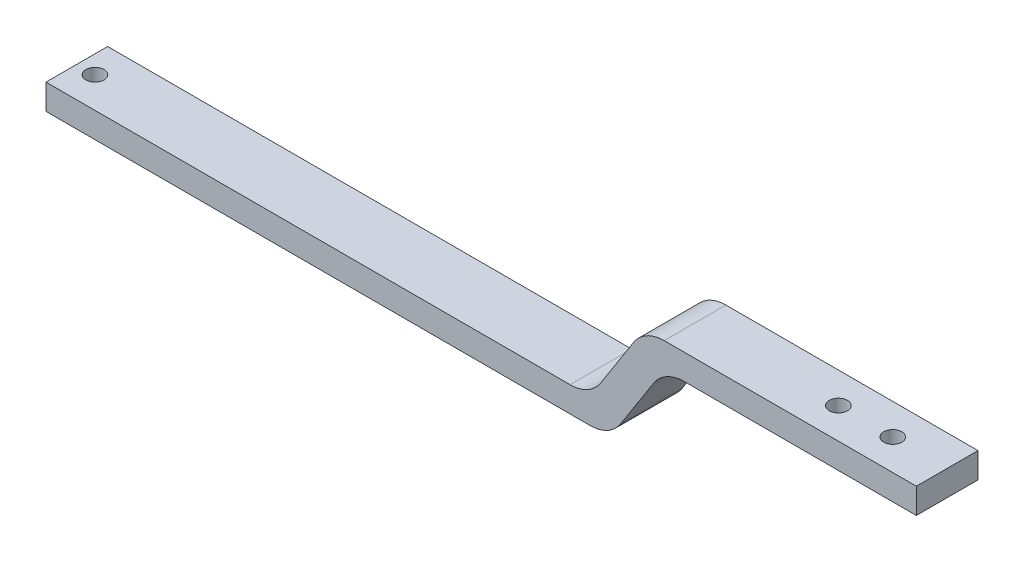
ISO-10303-21;
HEADER;
FILE_DESCRIPTION(('STEP AP214'),'2;1');
FILE_NAME('part.step','',(''),(''),'','','');
FILE_SCHEMA(('AUTOMOTIVE_DESIGN { 1 0 10303 214 1 1 1 1 }'));
ENDSEC;
DATA;
#1=APPLICATION_CONTEXT('core data for automotive mechanical design processes');
#2=APPLICATION_PROTOCOL_DEFINITION('international standard','automotive_design',2000,#1);
#3=PRODUCT_CONTEXT('',#1,'mechanical');
#4=PRODUCT('Part','Part','',(#3));
#5=PRODUCT_RELATED_PRODUCT_CATEGORY('part','',(#4));
#6=PRODUCT_DEFINITION_FORMATION('','',#4);
#7=PRODUCT_DEFINITION_CONTEXT('part definition',#1,'design');
#8=PRODUCT_DEFINITION('design','',#6,#7);
#9=PRODUCT_DEFINITION_SHAPE('','',#8);
#10=(LENGTH_UNIT() NAMED_UNIT(*) SI_UNIT(.MILLI.,.METRE.));
#11=(NAMED_UNIT(*) PLANE_ANGLE_UNIT() SI_UNIT($,.RADIAN.));
#12=(NAMED_UNIT(*) SI_UNIT($,.STERADIAN.) SOLID_ANGLE_UNIT());
#13=UNCERTAINTY_MEASURE_WITH_UNIT(LENGTH_MEASURE(1.E-05),#10,'distance_accuracy_value','');
#14=(GEOMETRIC_REPRESENTATION_CONTEXT(3) GLOBAL_UNCERTAINTY_ASSIGNED_CONTEXT((#13)) GLOBAL_UNIT_ASSIGNED_CONTEXT((#10,
#11,#12)) REPRESENTATION_CONTEXT('',''));
#15=CARTESIAN_POINT('',(0.,0.,0.));
#16=DIRECTION('',(0.,0.,1.));
#17=DIRECTION('',(1.,0.,0.));
#18=AXIS2_PLACEMENT_3D('',#15,#16,#17);
#19=CARTESIAN_POINT('',(-145.737121951069,7.82415955365122,17.));
#20=DIRECTION('',(1.,0.,0.));
#21=DIRECTION('',(0.,0.,-1.));
#22=AXIS2_PLACEMENT_3D('',#19,#20,#21);
#23=PLANE('',#22);
#24=DIRECTION('',(0.,-1.,0.));
#25=VECTOR('',#24,1.);
#26=CARTESIAN_POINT('',(-145.737121951069,7.82415955365122,0.));
#27=LINE('',#26,#25);
#28=CARTESIAN_POINT('',(-145.737121951069,14.8241595536512,0.));
#29=VERTEX_POINT('',#28);
#30=CARTESIAN_POINT('',(-145.737121951069,7.82415955365122,0.));
#31=VERTEX_POINT('',#30);
#32=EDGE_CURVE('E143',#29,#31,#27,.T.);
#33=ORIENTED_EDGE('',*,*,#32,.T.);
#34=DIRECTION('',(0.,0.,-1.));
#35=VECTOR('',#34,1.);
#36=CARTESIAN_POINT('',(-145.737121951069,7.82415955365122,17.));
#37=LINE('',#36,#35);
#38=CARTESIAN_POINT('',(-145.737121951069,7.82415955365122,17.));
#39=VERTEX_POINT('',#38);
#40=EDGE_CURVE('E126',#39,#31,#37,.T.);
#41=ORIENTED_EDGE('',*,*,#40,.F.);
#42=DIRECTION('',(0.,-1.,0.));
#43=VECTOR('',#42,1.);
#44=CARTESIAN_POINT('',(-145.737121951069,7.82415955365122,17.));
#45=LINE('',#44,#43);
#46=CARTESIAN_POINT('',(-145.737121951069,14.8241595536512,17.));
#47=VERTEX_POINT('',#46);
#48=EDGE_CURVE('E132',#47,#39,#45,.T.);
#49=ORIENTED_EDGE('',*,*,#48,.F.);
#50=DIRECTION('',(0.,0.,-1.));
#51=VECTOR('',#50,1.);
#52=CARTESIAN_POINT('',(-145.737121951069,14.8241595536512,17.));
#53=LINE('',#52,#51);
#54=EDGE_CURVE('E195',#47,#29,#53,.T.);
#55=ORIENTED_EDGE('',*,*,#54,.T.);
#56=EDGE_LOOP('',(#33,#41,#49,#55));
#57=FACE_BOUND('',#56,.T.);
#58=ADVANCED_FACE('F31',(#57),#23,.F.);
#59=CARTESIAN_POINT('',(9.76909552880012,7.82415955365124,17.));
#60=DIRECTION('',(0.,1.,0.));
#61=DIRECTION('',(-1.,0.,0.));
#62=AXIS2_PLACEMENT_3D('',#59,#60,#61);
#63=PLANE('',#62);
#64=CARTESIAN_POINT('',(-140.737121951069,7.82415955365122,8.5));
#65=DIRECTION('',(0.,-1.,0.));
#66=DIRECTION('',(1.,0.,0.));
#67=AXIS2_PLACEMENT_3D('',#64,#65,#66);
#68=CIRCLE('',#67,2.5);
#69=CARTESIAN_POINT('',(-138.237121951069,7.82415955365122,8.5));
#70=VERTEX_POINT('',#69);
#71=EDGE_CURVE('E249',#70,#70,#68,.T.);
#72=ORIENTED_EDGE('',*,*,#71,.F.);
#73=EDGE_LOOP('',(#72));
#74=FACE_BOUND('',#73,.T.);
#75=DIRECTION('',(1.,0.,0.));
#76=VECTOR('',#75,1.);
#77=CARTESIAN_POINT('',(9.76909552880012,7.82415955365124,0.));
#78=LINE('',#77,#76);
#79=CARTESIAN_POINT('',(4.28858330799105,7.82415955365124,0.));
#80=VERTEX_POINT('',#79);
#81=EDGE_CURVE('E204',#31,#80,#78,.T.);
#82=ORIENTED_EDGE('',*,*,#81,.T.);
#83=DIRECTION('',(0.,0.,-1.));
#84=VECTOR('',#83,1.);
#85=CARTESIAN_POINT('',(4.28858330799105,7.82415955365124,17.));
#86=LINE('',#85,#84);
#87=CARTESIAN_POINT('',(4.28858330799105,7.82415955365124,17.));
#88=VERTEX_POINT('',#87);
#89=EDGE_CURVE('E129',#80,#88,#86,.F.);
#90=ORIENTED_EDGE('',*,*,#89,.T.);
#91=DIRECTION('',(1.,0.,0.));
#92=VECTOR('',#91,1.);
#93=CARTESIAN_POINT('',(9.76909552880012,7.82415955365124,17.));
#94=LINE('',#93,#92);
#95=EDGE_CURVE('E121',#39,#88,#94,.T.);
#96=ORIENTED_EDGE('',*,*,#95,.F.);
#97=ORIENTED_EDGE('',*,*,#40,.T.);
#98=EDGE_LOOP('',(#82,#90,#96,#97));
#99=FACE_BOUND('',#98,.T.);
#100=ADVANCED_FACE('F124',(#74,#99),#63,.F.);
#101=CARTESIAN_POINT('',(24.7690955288001,31.3241595536512,17.));
#102=DIRECTION('',(-0.842922209577588,0.538035452921866,0.));
#103=DIRECTION('',(-0.538035452921866,-0.842922209577588,0.));
#104=AXIS2_PLACEMENT_3D('',#101,#102,#103);
#105=PLANE('',#104);
#106=DIRECTION('',(0.538035452921865,0.842922209577588,0.));
#107=VECTOR('',#106,1.);
#108=CARTESIAN_POINT('',(24.7690955288001,31.3241595536512,0.));
#109=LINE('',#108,#107);
#110=CARTESIAN_POINT('',(12.7178054037669,12.4438050244326,0.));
#111=VERTEX_POINT('',#110);
#112=CARTESIAN_POINT('',(21.8203856538333,26.7045140828699,0.));
#113=VERTEX_POINT('',#112);
#114=EDGE_CURVE('E207',#111,#113,#109,.T.);
#115=ORIENTED_EDGE('',*,*,#114,.T.);
#116=DIRECTION('',(0.,0.,-1.));
#117=VECTOR('',#116,1.);
#118=CARTESIAN_POINT('',(21.8203856538333,26.7045140828699,17.));
#119=LINE('',#118,#117);
#120=CARTESIAN_POINT('',(21.8203856538333,26.7045140828699,17.));
#121=VERTEX_POINT('',#120);
#122=EDGE_CURVE('E157',#113,#121,#119,.F.);
#123=ORIENTED_EDGE('',*,*,#122,.T.);
#124=DIRECTION('',(0.538035452921865,0.842922209577588,0.));
#125=VECTOR('',#124,1.);
#126=CARTESIAN_POINT('',(24.7690955288001,31.3241595536512,17.));
#127=LINE('',#126,#125);
#128=CARTESIAN_POINT('',(12.7178054037669,12.4438050244326,17.));
#129=VERTEX_POINT('',#128);
#130=EDGE_CURVE('E131',#129,#121,#127,.T.);
#131=ORIENTED_EDGE('',*,*,#130,.F.);
#132=DIRECTION('',(0.,0.,-1.));
#133=VECTOR('',#132,1.);
#134=CARTESIAN_POINT('',(12.7178054037669,12.4438050244326,17.));
#135=LINE('',#134,#133);
#136=EDGE_CURVE('E148',#129,#111,#135,.T.);
#137=ORIENTED_EDGE('',*,*,#136,.T.);
#138=EDGE_LOOP('',(#115,#123,#131,#137));
#139=FACE_BOUND('',#138,.T.);
#140=ADVANCED_FACE('F272',(#139),#105,.F.);
#141=CARTESIAN_POINT('',(94.262878048931,31.3241595536512,17.));
#142=DIRECTION('',(0.,1.,0.));
#143=DIRECTION('',(-1.,0.,0.));
#144=AXIS2_PLACEMENT_3D('',#141,#142,#143);
#145=PLANE('',#144);
#146=CARTESIAN_POINT('',(64.262878048931,31.3241595536512,8.5));
#147=DIRECTION('',(0.,1.,0.));
#148=DIRECTION('',(-1.,0.,0.));
#149=AXIS2_PLACEMENT_3D('',#146,#147,#148);
#150=CIRCLE('',#149,2.49999999999999);
#151=CARTESIAN_POINT('',(61.762878048931,31.3241595536512,8.5));
#152=VERTEX_POINT('',#151);
#153=EDGE_CURVE('E243',#152,#152,#150,.T.);
#154=ORIENTED_EDGE('',*,*,#153,.T.);
#155=EDGE_LOOP('',(#154));
#156=FACE_BOUND('',#155,.T.);
#157=CARTESIAN_POINT('',(79.262878048931,31.3241595536512,8.5));
#158=DIRECTION('',(0.,1.,0.));
#159=DIRECTION('',(-1.,0.,0.));
#160=AXIS2_PLACEMENT_3D('',#157,#158,#159);
#161=CIRCLE('',#160,2.49999999999999);
#162=CARTESIAN_POINT('',(76.762878048931,31.3241595536512,8.5));
#163=VERTEX_POINT('',#162);
#164=EDGE_CURVE('E205',#163,#163,#161,.T.);
#165=ORIENTED_EDGE('',*,*,#164,.T.);
#166=EDGE_LOOP('',(#165));
#167=FACE_BOUND('',#166,.T.);
#168=DIRECTION('',(1.,0.,0.));
#169=VECTOR('',#168,1.);
#170=CARTESIAN_POINT('',(94.262878048931,31.3241595536512,17.));
#171=LINE('',#170,#169);
#172=CARTESIAN_POINT('',(30.2496077496092,31.3241595536512,17.));
#173=VERTEX_POINT('',#172);
#174=CARTESIAN_POINT('',(94.262878048931,31.3241595536512,17.));
#175=VERTEX_POINT('',#174);
#176=EDGE_CURVE('E232',#173,#175,#171,.T.);
#177=ORIENTED_EDGE('',*,*,#176,.F.);
#178=DIRECTION('',(0.,0.,-1.));
#179=VECTOR('',#178,1.);
#180=CARTESIAN_POINT('',(30.2496077496092,31.3241595536512,0.));
#181=LINE('',#180,#179);
#182=CARTESIAN_POINT('',(30.2496077496092,31.3241595536512,0.));
#183=VERTEX_POINT('',#182);
#184=EDGE_CURVE('E144',#173,#183,#181,.T.);
#185=ORIENTED_EDGE('',*,*,#184,.T.);
#186=DIRECTION('',(1.,0.,0.));
#187=VECTOR('',#186,1.);
#188=CARTESIAN_POINT('',(94.262878048931,31.3241595536512,0.));
#189=LINE('',#188,#187);
#190=CARTESIAN_POINT('',(94.262878048931,31.3241595536512,0.));
#191=VERTEX_POINT('',#190);
#192=EDGE_CURVE('E210',#183,#191,#189,.T.);
#193=ORIENTED_EDGE('',*,*,#192,.T.);
#194=DIRECTION('',(0.,0.,-1.));
#195=VECTOR('',#194,1.);
#196=CARTESIAN_POINT('',(94.262878048931,31.3241595536512,17.));
#197=LINE('',#196,#195);
#198=EDGE_CURVE('E145',#175,#191,#197,.T.);
#199=ORIENTED_EDGE('',*,*,#198,.F.);
#200=EDGE_LOOP('',(#177,#185,#193,#199));
#201=FACE_BOUND('',#200,.T.);
#202=ADVANCED_FACE('F311',(#156,#167,#201),#145,.F.);
#203=CARTESIAN_POINT('',(94.262878048931,38.3241595536512,17.));
#204=DIRECTION('',(-1.,0.,0.));
#205=DIRECTION('',(0.,0.,1.));
#206=AXIS2_PLACEMENT_3D('',#203,#204,#205);
#207=PLANE('',#206);
#208=DIRECTION('',(0.,1.,0.));
#209=VECTOR('',#208,1.);
#210=CARTESIAN_POINT('',(94.262878048931,38.3241595536512,0.));
#211=LINE('',#210,#209);
#212=CARTESIAN_POINT('',(94.262878048931,38.3241595536512,0.));
#213=VERTEX_POINT('',#212);
#214=EDGE_CURVE('E212',#191,#213,#211,.T.);
#215=ORIENTED_EDGE('',*,*,#214,.T.);
#216=DIRECTION('',(0.,0.,-1.));
#217=VECTOR('',#216,1.);
#218=CARTESIAN_POINT('',(94.262878048931,38.3241595536512,17.));
#219=LINE('',#218,#217);
#220=CARTESIAN_POINT('',(94.262878048931,38.3241595536512,17.));
#221=VERTEX_POINT('',#220);
#222=EDGE_CURVE('E151',#221,#213,#219,.T.);
#223=ORIENTED_EDGE('',*,*,#222,.F.);
#224=DIRECTION('',(0.,1.,0.));
#225=VECTOR('',#224,1.);
#226=CARTESIAN_POINT('',(94.262878048931,38.3241595536512,17.));
#227=LINE('',#226,#225);
#228=EDGE_CURVE('E231',#175,#221,#227,.T.);
#229=ORIENTED_EDGE('',*,*,#228,.F.);
#230=ORIENTED_EDGE('',*,*,#198,.T.);
#231=EDGE_LOOP('',(#215,#223,#229,#230));
#232=FACE_BOUND('',#231,.T.);
#233=ADVANCED_FACE('F307',(#232),#207,.F.);
#234=CARTESIAN_POINT('',(19.262878048931,38.3241595536512,17.));
#235=DIRECTION('',(0.,-1.,0.));
#236=DIRECTION('',(0.,0.,-1.));
#237=AXIS2_PLACEMENT_3D('',#234,#235,#236);
#238=PLANE('',#237);
#239=CARTESIAN_POINT('',(64.262878048931,38.3241595536512,8.5));
#240=DIRECTION('',(0.,1.,0.));
#241=DIRECTION('',(0.,0.,1.));
#242=AXIS2_PLACEMENT_3D('',#239,#240,#241);
#243=CIRCLE('',#242,2.49999999999999);
#244=CARTESIAN_POINT('',(64.262878048931,38.3241595536512,11.));
#245=VERTEX_POINT('',#244);
#246=EDGE_CURVE('E246',#245,#245,#243,.T.);
#247=ORIENTED_EDGE('',*,*,#246,.F.);
#248=EDGE_LOOP('',(#247));
#249=FACE_BOUND('',#248,.T.);
#250=CARTESIAN_POINT('',(79.262878048931,38.3241595536512,8.5));
#251=DIRECTION('',(0.,1.,0.));
#252=DIRECTION('',(0.,0.,1.));
#253=AXIS2_PLACEMENT_3D('',#250,#251,#252);
#254=CIRCLE('',#253,2.49999999999999);
#255=CARTESIAN_POINT('',(79.262878048931,38.3241595536512,11.));
#256=VERTEX_POINT('',#255);
#257=EDGE_CURVE('E240',#256,#256,#254,.T.);
#258=ORIENTED_EDGE('',*,*,#257,.F.);
#259=EDGE_LOOP('',(#258));
#260=FACE_BOUND('',#259,.T.);
#261=DIRECTION('',(-1.,0.,0.));
#262=VECTOR('',#261,1.);
#263=CARTESIAN_POINT('',(19.262878048931,38.3241595536512,0.));
#264=LINE('',#263,#262);
#265=CARTESIAN_POINT('',(24.74339026974,38.3241595536512,0.));
#266=VERTEX_POINT('',#265);
#267=EDGE_CURVE('E191',#213,#266,#264,.T.);
#268=ORIENTED_EDGE('',*,*,#267,.T.);
#269=DIRECTION('',(0.,0.,-1.));
#270=VECTOR('',#269,1.);
#271=CARTESIAN_POINT('',(24.74339026974,38.3241595536512,17.));
#272=LINE('',#271,#270);
#273=CARTESIAN_POINT('',(24.74339026974,38.3241595536512,17.));
#274=VERTEX_POINT('',#273);
#275=EDGE_CURVE('E172',#266,#274,#272,.F.);
#276=ORIENTED_EDGE('',*,*,#275,.T.);
#277=DIRECTION('',(-1.,0.,0.));
#278=VECTOR('',#277,1.);
#279=CARTESIAN_POINT('',(19.262878048931,38.3241595536512,17.));
#280=LINE('',#279,#278);
#281=EDGE_CURVE('E199',#221,#274,#280,.T.);
#282=ORIENTED_EDGE('',*,*,#281,.F.);
#283=ORIENTED_EDGE('',*,*,#222,.T.);
#284=EDGE_LOOP('',(#268,#276,#282,#283));
#285=FACE_BOUND('',#284,.T.);
#286=ADVANCED_FACE('F221',(#249,#260,#285),#238,.F.);
#287=CARTESIAN_POINT('',(4.26287804893096,14.8241595536512,17.));
#288=DIRECTION('',(0.842922209577589,-0.538035452921865,0.));
#289=DIRECTION('',(0.538035452921865,0.842922209577588,0.));
#290=AXIS2_PLACEMENT_3D('',#287,#288,#289);
#291=PLANE('',#290);
#292=DIRECTION('',(-0.538035452921865,-0.842922209577588,0.));
#293=VECTOR('',#292,1.);
#294=CARTESIAN_POINT('',(4.26287804893096,14.8241595536512,17.));
#295=LINE('',#294,#293);
#296=CARTESIAN_POINT('',(16.3141681739641,33.7045140828699,17.));
#297=VERTEX_POINT('',#296);
#298=CARTESIAN_POINT('',(7.21158792389778,19.4438050244326,17.));
#299=VERTEX_POINT('',#298);
#300=EDGE_CURVE('E196',#297,#299,#295,.T.);
#301=ORIENTED_EDGE('',*,*,#300,.F.);
#302=DIRECTION('',(0.,0.,-1.));
#303=VECTOR('',#302,1.);
#304=CARTESIAN_POINT('',(16.3141681739641,33.7045140828699,17.));
#305=LINE('',#304,#303);
#306=CARTESIAN_POINT('',(16.3141681739641,33.7045140828699,0.));
#307=VERTEX_POINT('',#306);
#308=EDGE_CURVE('E169',#297,#307,#305,.T.);
#309=ORIENTED_EDGE('',*,*,#308,.T.);
#310=DIRECTION('',(-0.538035452921865,-0.842922209577588,0.));
#311=VECTOR('',#310,1.);
#312=CARTESIAN_POINT('',(4.26287804893096,14.8241595536512,0.));
#313=LINE('',#312,#311);
#314=CARTESIAN_POINT('',(7.21158792389778,19.4438050244326,0.));
#315=VERTEX_POINT('',#314);
#316=EDGE_CURVE('E186',#307,#315,#313,.T.);
#317=ORIENTED_EDGE('',*,*,#316,.T.);
#318=DIRECTION('',(0.,0.,-1.));
#319=VECTOR('',#318,1.);
#320=CARTESIAN_POINT('',(7.21158792389778,19.4438050244326,17.));
#321=LINE('',#320,#319);
#322=EDGE_CURVE('E53',#315,#299,#321,.F.);
#323=ORIENTED_EDGE('',*,*,#322,.T.);
#324=EDGE_LOOP('',(#301,#309,#317,#323));
#325=FACE_BOUND('',#324,.T.);
#326=ADVANCED_FACE('F189',(#325),#291,.F.);
#327=CARTESIAN_POINT('',(-145.737121951069,14.8241595536512,17.));
#328=DIRECTION('',(0.,-1.,0.));
#329=DIRECTION('',(0.,0.,-1.));
#330=AXIS2_PLACEMENT_3D('',#327,#328,#329);
#331=PLANE('',#330);
#332=CARTESIAN_POINT('',(-140.737121951069,14.8241595536512,8.5));
#333=DIRECTION('',(0.,-1.,0.));
#334=DIRECTION('',(0.,0.,-1.));
#335=AXIS2_PLACEMENT_3D('',#332,#333,#334);
#336=CIRCLE('',#335,2.5);
#337=CARTESIAN_POINT('',(-140.737121951069,14.8241595536512,6.00000000000001));
#338=VERTEX_POINT('',#337);
#339=EDGE_CURVE('E35',#338,#338,#336,.T.);
#340=ORIENTED_EDGE('',*,*,#339,.T.);
#341=EDGE_LOOP('',(#340));
#342=FACE_BOUND('',#341,.T.);
#343=DIRECTION('',(-1.,0.,0.));
#344=VECTOR('',#343,1.);
#345=CARTESIAN_POINT('',(-145.737121951069,14.8241595536512,17.));
#346=LINE('',#345,#344);
#347=CARTESIAN_POINT('',(-1.21763417187812,14.8241595536512,17.));
#348=VERTEX_POINT('',#347);
#349=EDGE_CURVE('E136',#348,#47,#346,.T.);
#350=ORIENTED_EDGE('',*,*,#349,.F.);
#351=DIRECTION('',(0.,0.,-1.));
#352=VECTOR('',#351,1.);
#353=CARTESIAN_POINT('',(-1.21763417187812,14.8241595536512,0.));
#354=LINE('',#353,#352);
#355=CARTESIAN_POINT('',(-1.21763417187812,14.8241595536512,0.));
#356=VERTEX_POINT('',#355);
#357=EDGE_CURVE('E174',#348,#356,#354,.T.);
#358=ORIENTED_EDGE('',*,*,#357,.T.);
#359=DIRECTION('',(-1.,0.,0.));
#360=VECTOR('',#359,1.);
#361=CARTESIAN_POINT('',(-145.737121951069,14.8241595536512,0.));
#362=LINE('',#361,#360);
#363=EDGE_CURVE('E140',#356,#29,#362,.T.);
#364=ORIENTED_EDGE('',*,*,#363,.T.);
#365=ORIENTED_EDGE('',*,*,#54,.F.);
#366=EDGE_LOOP('',(#350,#358,#364,#365));
#367=FACE_BOUND('',#366,.T.);
#368=ADVANCED_FACE('F194',(#342,#367),#331,.F.);
#369=CARTESIAN_POINT('',(-145.737121951069,14.8241595536512,17.));
#370=DIRECTION('',(0.,0.,-1.));
#371=DIRECTION('',(-1.,0.,0.));
#372=AXIS2_PLACEMENT_3D('',#369,#370,#371);
#373=PLANE('',#372);
#374=ORIENTED_EDGE('',*,*,#95,.T.);
#375=CARTESIAN_POINT('',(4.28858330799105,17.8241595536512,17.));
#376=DIRECTION('',(0.,0.,-1.));
#377=DIRECTION('',(-1.,0.,0.));
#378=AXIS2_PLACEMENT_3D('',#375,#376,#377);
#379=CIRCLE('',#378,10.);
#380=EDGE_CURVE('E166',#88,#129,#379,.F.);
#381=ORIENTED_EDGE('',*,*,#380,.T.);
#382=ORIENTED_EDGE('',*,*,#130,.T.);
#383=CARTESIAN_POINT('',(30.2496077496092,21.3241595536512,17.));
#384=DIRECTION('',(0.,0.,-1.));
#385=DIRECTION('',(-1.,0.,0.));
#386=AXIS2_PLACEMENT_3D('',#383,#384,#385);
#387=CIRCLE('',#386,10.);
#388=EDGE_CURVE('E179',#121,#173,#387,.T.);
#389=ORIENTED_EDGE('',*,*,#388,.T.);
#390=ORIENTED_EDGE('',*,*,#176,.T.);
#391=ORIENTED_EDGE('',*,*,#228,.T.);
#392=ORIENTED_EDGE('',*,*,#281,.T.);
#393=CARTESIAN_POINT('',(24.74339026974,28.3241595536512,17.));
#394=DIRECTION('',(0.,0.,-1.));
#395=DIRECTION('',(-1.,0.,0.));
#396=AXIS2_PLACEMENT_3D('',#393,#394,#395);
#397=CIRCLE('',#396,10.);
#398=EDGE_CURVE('E164',#274,#297,#397,.F.);
#399=ORIENTED_EDGE('',*,*,#398,.T.);
#400=ORIENTED_EDGE('',*,*,#300,.T.);
#401=CARTESIAN_POINT('',(-1.21763417187812,24.8241595536512,17.));
#402=DIRECTION('',(0.,0.,-1.));
#403=DIRECTION('',(-1.,0.,0.));
#404=AXIS2_PLACEMENT_3D('',#401,#402,#403);
#405=CIRCLE('',#404,10.);
#406=EDGE_CURVE('E11',#299,#348,#405,.T.);
#407=ORIENTED_EDGE('',*,*,#406,.T.);
#408=ORIENTED_EDGE('',*,*,#349,.T.);
#409=ORIENTED_EDGE('',*,*,#48,.T.);
#410=EDGE_LOOP('',(#374,#381,#382,#389,#390,#391,#392,#399,#400,#407,#408,#409));
#411=FACE_BOUND('',#410,.T.);
#412=ADVANCED_FACE('F135',(#411),#373,.F.);
#413=CARTESIAN_POINT('',(-145.737121951069,14.8241595536512,0.));
#414=DIRECTION('',(0.,0.,-1.));
#415=DIRECTION('',(-1.,0.,0.));
#416=AXIS2_PLACEMENT_3D('',#413,#414,#415);
#417=PLANE('',#416);
#418=ORIENTED_EDGE('',*,*,#114,.F.);
#419=CARTESIAN_POINT('',(4.28858330799105,17.8241595536512,0.));
#420=DIRECTION('',(0.,0.,-1.));
#421=DIRECTION('',(-1.,0.,0.));
#422=AXIS2_PLACEMENT_3D('',#419,#420,#421);
#423=CIRCLE('',#422,10.);
#424=EDGE_CURVE('E161',#111,#80,#423,.T.);
#425=ORIENTED_EDGE('',*,*,#424,.T.);
#426=ORIENTED_EDGE('',*,*,#81,.F.);
#427=ORIENTED_EDGE('',*,*,#32,.F.);
#428=ORIENTED_EDGE('',*,*,#363,.F.);
#429=CARTESIAN_POINT('',(-1.21763417187812,24.8241595536512,0.));
#430=DIRECTION('',(0.,0.,-1.));
#431=DIRECTION('',(-1.,0.,0.));
#432=AXIS2_PLACEMENT_3D('',#429,#430,#431);
#433=CIRCLE('',#432,10.);
#434=EDGE_CURVE('E40',#356,#315,#433,.F.);
#435=ORIENTED_EDGE('',*,*,#434,.T.);
#436=ORIENTED_EDGE('',*,*,#316,.F.);
#437=CARTESIAN_POINT('',(24.74339026974,28.3241595536512,0.));
#438=DIRECTION('',(0.,0.,-1.));
#439=DIRECTION('',(-1.,0.,0.));
#440=AXIS2_PLACEMENT_3D('',#437,#438,#439);
#441=CIRCLE('',#440,10.);
#442=EDGE_CURVE('E159',#307,#266,#441,.T.);
#443=ORIENTED_EDGE('',*,*,#442,.T.);
#444=ORIENTED_EDGE('',*,*,#267,.F.);
#445=ORIENTED_EDGE('',*,*,#214,.F.);
#446=ORIENTED_EDGE('',*,*,#192,.F.);
#447=CARTESIAN_POINT('',(30.2496077496092,21.3241595536512,0.));
#448=DIRECTION('',(0.,0.,-1.));
#449=DIRECTION('',(-1.,0.,0.));
#450=AXIS2_PLACEMENT_3D('',#447,#448,#449);
#451=CIRCLE('',#450,10.);
#452=EDGE_CURVE('E177',#183,#113,#451,.F.);
#453=ORIENTED_EDGE('',*,*,#452,.T.);
#454=EDGE_LOOP('',(#418,#425,#426,#427,#428,#435,#436,#443,#444,#445,#446,#453));
#455=FACE_BOUND('',#454,.T.);
#456=ADVANCED_FACE('F185',(#455),#417,.T.);
#457=CARTESIAN_POINT('',(30.2496077496092,21.3241595536512,17.));
#458=DIRECTION('',(0.,0.,1.));
#459=DIRECTION('',(1.,0.,0.));
#460=AXIS2_PLACEMENT_3D('',#457,#458,#459);
#461=CYLINDRICAL_SURFACE('',#460,10.);
#462=ORIENTED_EDGE('',*,*,#388,.F.);
#463=ORIENTED_EDGE('',*,*,#122,.F.);
#464=ORIENTED_EDGE('',*,*,#452,.F.);
#465=ORIENTED_EDGE('',*,*,#184,.F.);
#466=EDGE_LOOP('',(#462,#463,#464,#465));
#467=FACE_BOUND('',#466,.T.);
#468=ADVANCED_FACE('F277',(#467),#461,.F.);
#469=CARTESIAN_POINT('',(4.28858330799105,17.8241595536512,17.));
#470=DIRECTION('',(0.,0.,-1.));
#471=DIRECTION('',(-1.,0.,0.));
#472=AXIS2_PLACEMENT_3D('',#469,#470,#471);
#473=CYLINDRICAL_SURFACE('',#472,10.);
#474=ORIENTED_EDGE('',*,*,#380,.F.);
#475=ORIENTED_EDGE('',*,*,#89,.F.);
#476=ORIENTED_EDGE('',*,*,#424,.F.);
#477=ORIENTED_EDGE('',*,*,#136,.F.);
#478=EDGE_LOOP('',(#474,#475,#476,#477));
#479=FACE_BOUND('',#478,.T.);
#480=ADVANCED_FACE('F280',(#479),#473,.T.);
#481=CARTESIAN_POINT('',(24.74339026974,28.3241595536512,17.));
#482=DIRECTION('',(0.,0.,-1.));
#483=DIRECTION('',(-1.,0.,0.));
#484=AXIS2_PLACEMENT_3D('',#481,#482,#483);
#485=CYLINDRICAL_SURFACE('',#484,10.);
#486=ORIENTED_EDGE('',*,*,#398,.F.);
#487=ORIENTED_EDGE('',*,*,#275,.F.);
#488=ORIENTED_EDGE('',*,*,#442,.F.);
#489=ORIENTED_EDGE('',*,*,#308,.F.);
#490=EDGE_LOOP('',(#486,#487,#488,#489));
#491=FACE_BOUND('',#490,.T.);
#492=ADVANCED_FACE('F230',(#491),#485,.T.);
#493=CARTESIAN_POINT('',(-1.21763417187812,24.8241595536512,17.));
#494=DIRECTION('',(0.,0.,1.));
#495=DIRECTION('',(1.,0.,0.));
#496=AXIS2_PLACEMENT_3D('',#493,#494,#495);
#497=CYLINDRICAL_SURFACE('',#496,10.);
#498=ORIENTED_EDGE('',*,*,#406,.F.);
#499=ORIENTED_EDGE('',*,*,#322,.F.);
#500=ORIENTED_EDGE('',*,*,#434,.F.);
#501=ORIENTED_EDGE('',*,*,#357,.F.);
#502=EDGE_LOOP('',(#498,#499,#500,#501));
#503=FACE_BOUND('',#502,.T.);
#504=ADVANCED_FACE('F33',(#503),#497,.F.);
#505=CARTESIAN_POINT('',(79.262878048931,21.3241595536512,8.5));
#506=DIRECTION('',(0.,1.,0.));
#507=DIRECTION('',(0.,0.,1.));
#508=AXIS2_PLACEMENT_3D('',#505,#506,#507);
#509=CYLINDRICAL_SURFACE('',#508,2.49999999999999);
#510=ORIENTED_EDGE('',*,*,#257,.T.);
#511=EDGE_LOOP('',(#510));
#512=FACE_BOUND('',#511,.T.);
#513=ORIENTED_EDGE('',*,*,#164,.F.);
#514=EDGE_LOOP('',(#513));
#515=FACE_BOUND('',#514,.T.);
#516=ADVANCED_FACE('F264',(#512,#515),#509,.F.);
#517=CARTESIAN_POINT('',(64.262878048931,21.3241595536512,8.5));
#518=DIRECTION('',(0.,1.,0.));
#519=DIRECTION('',(0.,0.,1.));
#520=AXIS2_PLACEMENT_3D('',#517,#518,#519);
#521=CYLINDRICAL_SURFACE('',#520,2.49999999999999);
#522=ORIENTED_EDGE('',*,*,#246,.T.);
#523=EDGE_LOOP('',(#522));
#524=FACE_BOUND('',#523,.T.);
#525=ORIENTED_EDGE('',*,*,#153,.F.);
#526=EDGE_LOOP('',(#525));
#527=FACE_BOUND('',#526,.T.);
#528=ADVANCED_FACE('F259',(#524,#527),#521,.F.);
#529=CARTESIAN_POINT('',(-140.737121951069,24.8241595536512,8.5));
#530=DIRECTION('',(0.,-1.,0.));
#531=DIRECTION('',(1.,0.,0.));
#532=AXIS2_PLACEMENT_3D('',#529,#530,#531);
#533=CYLINDRICAL_SURFACE('',#532,2.5);
#534=ORIENTED_EDGE('',*,*,#71,.T.);
#535=EDGE_LOOP('',(#534));
#536=FACE_BOUND('',#535,.T.);
#537=ORIENTED_EDGE('',*,*,#339,.F.);
#538=EDGE_LOOP('',(#537));
#539=FACE_BOUND('',#538,.T.);
#540=ADVANCED_FACE('F257',(#536,#539),#533,.F.);
#541=CLOSED_SHELL('',(#58,#100,#140,#202,#233,#286,#326,#368,#412,#456,#468,#480,#492,#504,#516,
#528,#540));
#542=MANIFOLD_SOLID_BREP('B2',#541);
#543=ADVANCED_BREP_SHAPE_REPRESENTATION('',(#18,#542),#14);
#544=SHAPE_DEFINITION_REPRESENTATION(#9,#543);
ENDSEC;
END-ISO-10303-21;
